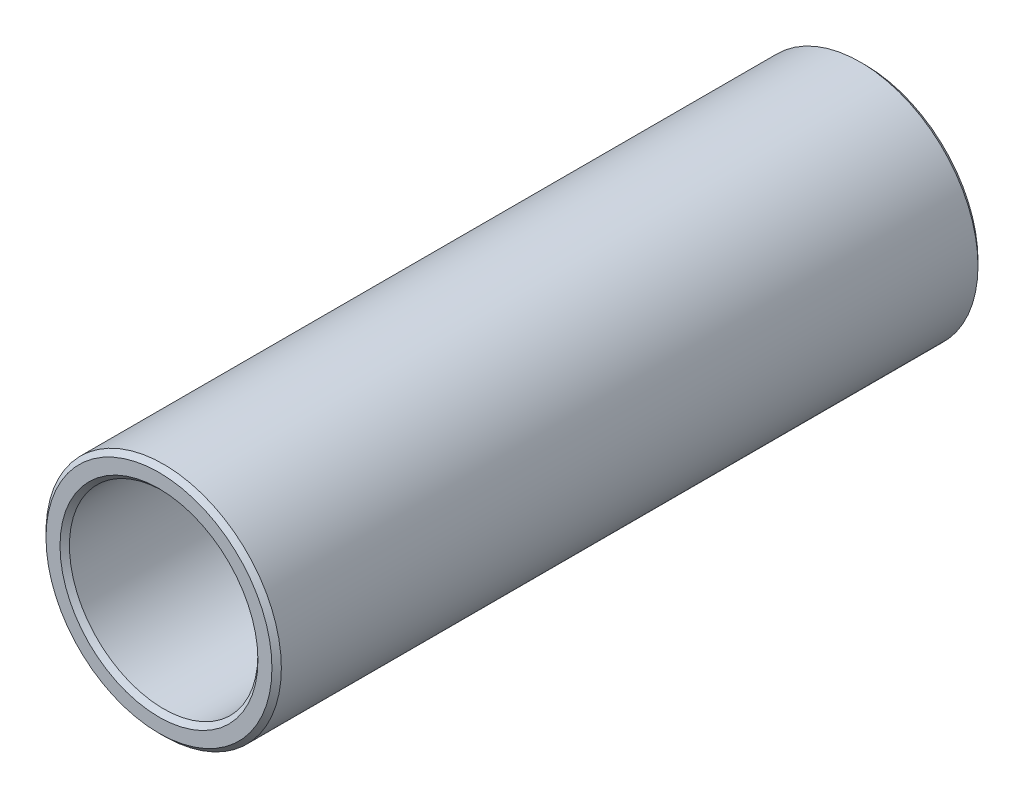
ISO-10303-21;
HEADER;
FILE_DESCRIPTION(('STEP AP214'),'2;1');
FILE_NAME('part.step','',(''),(''),'','','');
FILE_SCHEMA(('AUTOMOTIVE_DESIGN { 1 0 10303 214 1 1 1 1 }'));
ENDSEC;
DATA;
#1=APPLICATION_CONTEXT('core data for automotive mechanical design processes');
#2=APPLICATION_PROTOCOL_DEFINITION('international standard','automotive_design',2000,#1);
#3=PRODUCT_CONTEXT('',#1,'mechanical');
#4=PRODUCT('Part','Part','',(#3));
#5=PRODUCT_RELATED_PRODUCT_CATEGORY('part','',(#4));
#6=PRODUCT_DEFINITION_FORMATION('','',#4);
#7=PRODUCT_DEFINITION_CONTEXT('part definition',#1,'design');
#8=PRODUCT_DEFINITION('design','',#6,#7);
#9=PRODUCT_DEFINITION_SHAPE('','',#8);
#10=(LENGTH_UNIT() NAMED_UNIT(*) SI_UNIT(.MILLI.,.METRE.));
#11=(NAMED_UNIT(*) PLANE_ANGLE_UNIT() SI_UNIT($,.RADIAN.));
#12=(NAMED_UNIT(*) SI_UNIT($,.STERADIAN.) SOLID_ANGLE_UNIT());
#13=UNCERTAINTY_MEASURE_WITH_UNIT(LENGTH_MEASURE(1.E-05),#10,'distance_accuracy_value','');
#14=(GEOMETRIC_REPRESENTATION_CONTEXT(3) GLOBAL_UNCERTAINTY_ASSIGNED_CONTEXT((#13)) GLOBAL_UNIT_ASSIGNED_CONTEXT((#10,
#11,#12)) REPRESENTATION_CONTEXT('',''));
#15=CARTESIAN_POINT('',(0.,0.,0.));
#16=DIRECTION('',(0.,0.,1.));
#17=DIRECTION('',(1.,0.,0.));
#18=AXIS2_PLACEMENT_3D('',#15,#16,#17);
#19=CARTESIAN_POINT('',(0.,0.,30.));
#20=DIRECTION('',(0.,0.,1.));
#21=DIRECTION('',(1.,0.,0.));
#22=AXIS2_PLACEMENT_3D('',#19,#20,#21);
#23=PLANE('',#22);
#24=CARTESIAN_POINT('',(0.,0.,30.));
#25=DIRECTION('',(0.,0.,1.));
#26=DIRECTION('',(1.,0.,0.));
#27=AXIS2_PLACEMENT_3D('',#24,#25,#26);
#28=CIRCLE('',#27,4.205);
#29=CARTESIAN_POINT('',(4.205,0.,30.));
#30=VERTEX_POINT('',#29);
#31=EDGE_CURVE('E42',#30,#30,#28,.F.);
#32=ORIENTED_EDGE('',*,*,#31,.T.);
#33=EDGE_LOOP('',(#32));
#34=FACE_BOUND('',#33,.T.);
#35=CARTESIAN_POINT('',(0.,0.,30.));
#36=DIRECTION('',(0.,0.,1.));
#37=DIRECTION('',(1.,0.,0.));
#38=AXIS2_PLACEMENT_3D('',#35,#36,#37);
#39=CIRCLE('',#38,4.8);
#40=CARTESIAN_POINT('',(4.8,0.,30.));
#41=VERTEX_POINT('',#40);
#42=EDGE_CURVE('E46',#41,#41,#39,.T.);
#43=ORIENTED_EDGE('',*,*,#42,.T.);
#44=EDGE_LOOP('',(#43));
#45=FACE_BOUND('',#44,.T.);
#46=ADVANCED_FACE('F31',(#34,#45),#23,.T.);
#47=CARTESIAN_POINT('',(0.,0.,0.));
#48=DIRECTION('',(0.,0.,1.));
#49=DIRECTION('',(1.,0.,0.));
#50=AXIS2_PLACEMENT_3D('',#47,#48,#49);
#51=PLANE('',#50);
#52=CARTESIAN_POINT('',(0.,0.,0.));
#53=DIRECTION('',(0.,0.,1.));
#54=DIRECTION('',(1.,0.,0.));
#55=AXIS2_PLACEMENT_3D('',#52,#53,#54);
#56=CIRCLE('',#55,4.205);
#57=CARTESIAN_POINT('',(4.205,0.,0.));
#58=VERTEX_POINT('',#57);
#59=EDGE_CURVE('E57',#58,#58,#56,.T.);
#60=ORIENTED_EDGE('',*,*,#59,.T.);
#61=EDGE_LOOP('',(#60));
#62=FACE_BOUND('',#61,.T.);
#63=CARTESIAN_POINT('',(0.,0.,0.));
#64=DIRECTION('',(0.,0.,1.));
#65=DIRECTION('',(1.,0.,0.));
#66=AXIS2_PLACEMENT_3D('',#63,#64,#65);
#67=CIRCLE('',#66,4.8);
#68=CARTESIAN_POINT('',(4.8,0.,0.));
#69=VERTEX_POINT('',#68);
#70=EDGE_CURVE('E60',#69,#69,#67,.F.);
#71=ORIENTED_EDGE('',*,*,#70,.T.);
#72=EDGE_LOOP('',(#71));
#73=FACE_BOUND('',#72,.T.);
#74=ADVANCED_FACE('F64',(#62,#73),#51,.F.);
#75=CARTESIAN_POINT('',(0.,0.,30.));
#76=DIRECTION('',(0.,0.,-1.));
#77=DIRECTION('',(-1.,0.,0.));
#78=AXIS2_PLACEMENT_3D('',#75,#76,#77);
#79=CYLINDRICAL_SURFACE('',#78,5.);
#80=CARTESIAN_POINT('',(0.,0.,0.199999999999999));
#81=DIRECTION('',(0.,0.,1.));
#82=DIRECTION('',(1.,0.,0.));
#83=AXIS2_PLACEMENT_3D('',#80,#81,#82);
#84=CIRCLE('',#83,5.);
#85=CARTESIAN_POINT('',(5.,0.,0.199999999999999));
#86=VERTEX_POINT('',#85);
#87=EDGE_CURVE('E10',#86,#86,#84,.T.);
#88=ORIENTED_EDGE('',*,*,#87,.T.);
#89=EDGE_LOOP('',(#88));
#90=FACE_BOUND('',#89,.T.);
#91=CARTESIAN_POINT('',(0.,0.,29.8));
#92=DIRECTION('',(0.,0.,1.));
#93=DIRECTION('',(1.,0.,0.));
#94=AXIS2_PLACEMENT_3D('',#91,#92,#93);
#95=CIRCLE('',#94,5.);
#96=CARTESIAN_POINT('',(5.,0.,29.8));
#97=VERTEX_POINT('',#96);
#98=EDGE_CURVE('E38',#97,#97,#95,.F.);
#99=ORIENTED_EDGE('',*,*,#98,.T.);
#100=EDGE_LOOP('',(#99));
#101=FACE_BOUND('',#100,.T.);
#102=ADVANCED_FACE('F84',(#90,#101),#79,.T.);
#103=CARTESIAN_POINT('',(0.,0.,30.));
#104=DIRECTION('',(0.,0.,-1.));
#105=DIRECTION('',(-1.,0.,0.));
#106=AXIS2_PLACEMENT_3D('',#103,#104,#105);
#107=CYLINDRICAL_SURFACE('',#106,4.005);
#108=CARTESIAN_POINT('',(0.,0.,0.199999999999995));
#109=DIRECTION('',(0.,0.,1.));
#110=DIRECTION('',(1.,0.,0.));
#111=AXIS2_PLACEMENT_3D('',#108,#109,#110);
#112=CIRCLE('',#111,4.005);
#113=CARTESIAN_POINT('',(4.005,0.,0.199999999999995));
#114=VERTEX_POINT('',#113);
#115=EDGE_CURVE('E51',#114,#114,#112,.F.);
#116=ORIENTED_EDGE('',*,*,#115,.T.);
#117=EDGE_LOOP('',(#116));
#118=FACE_BOUND('',#117,.T.);
#119=CARTESIAN_POINT('',(0.,0.,29.8));
#120=DIRECTION('',(0.,0.,1.));
#121=DIRECTION('',(1.,0.,0.));
#122=AXIS2_PLACEMENT_3D('',#119,#120,#121);
#123=CIRCLE('',#122,4.005);
#124=CARTESIAN_POINT('',(4.005,0.,29.8));
#125=VERTEX_POINT('',#124);
#126=EDGE_CURVE('E54',#125,#125,#123,.T.);
#127=ORIENTED_EDGE('',*,*,#126,.T.);
#128=EDGE_LOOP('',(#127));
#129=FACE_BOUND('',#128,.T.);
#130=ADVANCED_FACE('F89',(#118,#129),#107,.F.);
#131=CARTESIAN_POINT('',(0.,0.,0.));
#132=DIRECTION('',(0.,0.,-1.));
#133=DIRECTION('',(-1.,0.,0.));
#134=AXIS2_PLACEMENT_3D('',#131,#132,#133);
#135=CONICAL_SURFACE('',#134,4.205,0.785398163397453);
#136=ORIENTED_EDGE('',*,*,#115,.F.);
#137=EDGE_LOOP('',(#136));
#138=FACE_BOUND('',#137,.T.);
#139=ORIENTED_EDGE('',*,*,#59,.F.);
#140=EDGE_LOOP('',(#139));
#141=FACE_BOUND('',#140,.T.);
#142=ADVANCED_FACE('F75',(#138,#141),#135,.F.);
#143=CARTESIAN_POINT('',(0.,0.,29.8));
#144=DIRECTION('',(0.,0.,1.));
#145=DIRECTION('',(1.,0.,0.));
#146=AXIS2_PLACEMENT_3D('',#143,#144,#145);
#147=CONICAL_SURFACE('',#146,4.005,0.785398163397435);
#148=ORIENTED_EDGE('',*,*,#31,.F.);
#149=EDGE_LOOP('',(#148));
#150=FACE_BOUND('',#149,.T.);
#151=ORIENTED_EDGE('',*,*,#126,.F.);
#152=EDGE_LOOP('',(#151));
#153=FACE_BOUND('',#152,.T.);
#154=ADVANCED_FACE('F69',(#150,#153),#147,.F.);
#155=CARTESIAN_POINT('',(0.,0.,0.199999999999999));
#156=DIRECTION('',(0.,0.,1.));
#157=DIRECTION('',(1.,0.,0.));
#158=AXIS2_PLACEMENT_3D('',#155,#156,#157);
#159=CONICAL_SURFACE('',#158,5.,0.785398163397455);
#160=ORIENTED_EDGE('',*,*,#70,.F.);
#161=EDGE_LOOP('',(#160));
#162=FACE_BOUND('',#161,.T.);
#163=ORIENTED_EDGE('',*,*,#87,.F.);
#164=EDGE_LOOP('',(#163));
#165=FACE_BOUND('',#164,.T.);
#166=ADVANCED_FACE('F66',(#162,#165),#159,.T.);
#167=CARTESIAN_POINT('',(0.,0.,30.));
#168=DIRECTION('',(0.,0.,-1.));
#169=DIRECTION('',(-1.,0.,0.));
#170=AXIS2_PLACEMENT_3D('',#167,#168,#169);
#171=CONICAL_SURFACE('',#170,4.8,0.785398163397463);
#172=ORIENTED_EDGE('',*,*,#98,.F.);
#173=EDGE_LOOP('',(#172));
#174=FACE_BOUND('',#173,.T.);
#175=ORIENTED_EDGE('',*,*,#42,.F.);
#176=EDGE_LOOP('',(#175));
#177=FACE_BOUND('',#176,.T.);
#178=ADVANCED_FACE('F33',(#174,#177),#171,.T.);
#179=CLOSED_SHELL('',(#46,#74,#102,#130,#142,#154,#166,#178));
#180=MANIFOLD_SOLID_BREP('B2',#179);
#181=ADVANCED_BREP_SHAPE_REPRESENTATION('',(#18,#180),#14);
#182=SHAPE_DEFINITION_REPRESENTATION(#9,#181);
ENDSEC;
END-ISO-10303-21;
